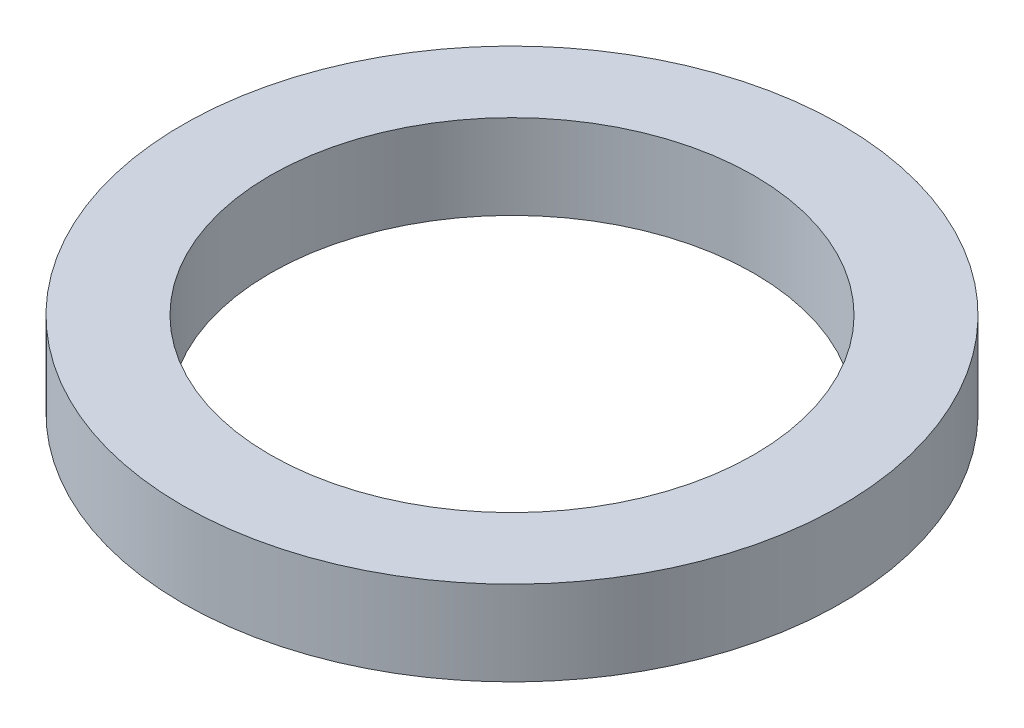
ISO-10303-21;
HEADER;
FILE_DESCRIPTION(('STEP AP214'),'2;1');
FILE_NAME('part.step','',(''),(''),'','','');
FILE_SCHEMA(('AUTOMOTIVE_DESIGN { 1 0 10303 214 1 1 1 1 }'));
ENDSEC;
DATA;
#1=APPLICATION_CONTEXT('core data for automotive mechanical design processes');
#2=APPLICATION_PROTOCOL_DEFINITION('international standard','automotive_design',2000,#1);
#3=PRODUCT_CONTEXT('',#1,'mechanical');
#4=PRODUCT('Part','Part','',(#3));
#5=PRODUCT_RELATED_PRODUCT_CATEGORY('part','',(#4));
#6=PRODUCT_DEFINITION_FORMATION('','',#4);
#7=PRODUCT_DEFINITION_CONTEXT('part definition',#1,'design');
#8=PRODUCT_DEFINITION('design','',#6,#7);
#9=PRODUCT_DEFINITION_SHAPE('','',#8);
#10=(LENGTH_UNIT() NAMED_UNIT(*) SI_UNIT(.MILLI.,.METRE.));
#11=(NAMED_UNIT(*) PLANE_ANGLE_UNIT() SI_UNIT($,.RADIAN.));
#12=(NAMED_UNIT(*) SI_UNIT($,.STERADIAN.) SOLID_ANGLE_UNIT());
#13=UNCERTAINTY_MEASURE_WITH_UNIT(LENGTH_MEASURE(1.E-05),#10,'distance_accuracy_value','');
#14=(GEOMETRIC_REPRESENTATION_CONTEXT(3) GLOBAL_UNCERTAINTY_ASSIGNED_CONTEXT((#13)) GLOBAL_UNIT_ASSIGNED_CONTEXT((#10,
#11,#12)) REPRESENTATION_CONTEXT('',''));
#15=CARTESIAN_POINT('',(0.,0.,0.));
#16=DIRECTION('',(0.,0.,1.));
#17=DIRECTION('',(1.,0.,0.));
#18=AXIS2_PLACEMENT_3D('',#15,#16,#17);
#19=CARTESIAN_POINT('',(0.,2.8,0.));
#20=DIRECTION('',(0.,1.,0.));
#21=DIRECTION('',(0.,0.,1.));
#22=AXIS2_PLACEMENT_3D('',#19,#20,#21);
#23=PLANE('',#22);
#24=CARTESIAN_POINT('',(0.,2.8,0.));
#25=DIRECTION('',(0.,1.,0.));
#26=DIRECTION('',(0.,0.,1.));
#27=AXIS2_PLACEMENT_3D('',#24,#25,#26);
#28=CIRCLE('',#27,10.9);
#29=CARTESIAN_POINT('',(0.,2.8,10.9));
#30=VERTEX_POINT('',#29);
#31=EDGE_CURVE('E10',#30,#30,#28,.T.);
#32=ORIENTED_EDGE('',*,*,#31,.T.);
#33=EDGE_LOOP('',(#32));
#34=FACE_BOUND('',#33,.T.);
#35=CARTESIAN_POINT('',(0.,2.8,0.));
#36=DIRECTION('',(0.,1.,0.));
#37=DIRECTION('',(0.,0.,1.));
#38=AXIS2_PLACEMENT_3D('',#35,#36,#37);
#39=CIRCLE('',#38,8.);
#40=CARTESIAN_POINT('',(0.,2.8,8.));
#41=VERTEX_POINT('',#40);
#42=EDGE_CURVE('E50',#41,#41,#39,.T.);
#43=ORIENTED_EDGE('',*,*,#42,.F.);
#44=EDGE_LOOP('',(#43));
#45=FACE_BOUND('',#44,.T.);
#46=ADVANCED_FACE('F37',(#34,#45),#23,.T.);
#47=CARTESIAN_POINT('',(0.,0.,0.));
#48=DIRECTION('',(0.,1.,0.));
#49=DIRECTION('',(0.,0.,1.));
#50=AXIS2_PLACEMENT_3D('',#47,#48,#49);
#51=PLANE('',#50);
#52=CARTESIAN_POINT('',(0.,0.,0.));
#53=DIRECTION('',(0.,1.,0.));
#54=DIRECTION('',(0.,0.,1.));
#55=AXIS2_PLACEMENT_3D('',#52,#53,#54);
#56=CIRCLE('',#55,10.9);
#57=CARTESIAN_POINT('',(0.,0.,10.9));
#58=VERTEX_POINT('',#57);
#59=EDGE_CURVE('E41',#58,#58,#56,.T.);
#60=ORIENTED_EDGE('',*,*,#59,.F.);
#61=EDGE_LOOP('',(#60));
#62=FACE_BOUND('',#61,.T.);
#63=CARTESIAN_POINT('',(0.,0.,0.));
#64=DIRECTION('',(0.,1.,0.));
#65=DIRECTION('',(0.,0.,1.));
#66=AXIS2_PLACEMENT_3D('',#63,#64,#65);
#67=CIRCLE('',#66,8.);
#68=CARTESIAN_POINT('',(0.,0.,8.));
#69=VERTEX_POINT('',#68);
#70=EDGE_CURVE('E52',#69,#69,#67,.T.);
#71=ORIENTED_EDGE('',*,*,#70,.T.);
#72=EDGE_LOOP('',(#71));
#73=FACE_BOUND('',#72,.T.);
#74=ADVANCED_FACE('F64',(#62,#73),#51,.F.);
#75=CARTESIAN_POINT('',(0.,2.8,0.));
#76=DIRECTION('',(0.,-1.,0.));
#77=DIRECTION('',(0.,0.,-1.));
#78=AXIS2_PLACEMENT_3D('',#75,#76,#77);
#79=CYLINDRICAL_SURFACE('',#78,10.9);
#80=ORIENTED_EDGE('',*,*,#31,.F.);
#81=EDGE_LOOP('',(#80));
#82=FACE_BOUND('',#81,.T.);
#83=ORIENTED_EDGE('',*,*,#59,.T.);
#84=EDGE_LOOP('',(#83));
#85=FACE_BOUND('',#84,.T.);
#86=ADVANCED_FACE('F39',(#82,#85),#79,.T.);
#87=CARTESIAN_POINT('',(0.,2.8,0.));
#88=DIRECTION('',(0.,-1.,0.));
#89=DIRECTION('',(0.,0.,-1.));
#90=AXIS2_PLACEMENT_3D('',#87,#88,#89);
#91=CYLINDRICAL_SURFACE('',#90,8.);
#92=ORIENTED_EDGE('',*,*,#42,.T.);
#93=EDGE_LOOP('',(#92));
#94=FACE_BOUND('',#93,.T.);
#95=ORIENTED_EDGE('',*,*,#70,.F.);
#96=EDGE_LOOP('',(#95));
#97=FACE_BOUND('',#96,.T.);
#98=ADVANCED_FACE('F60',(#94,#97),#91,.F.);
#99=CLOSED_SHELL('',(#46,#74,#86,#98));
#100=MANIFOLD_SOLID_BREP('B2',#99);
#101=ADVANCED_BREP_SHAPE_REPRESENTATION('',(#18,#100),#14);
#102=SHAPE_DEFINITION_REPRESENTATION(#9,#101);
ENDSEC;
END-ISO-10303-21;
